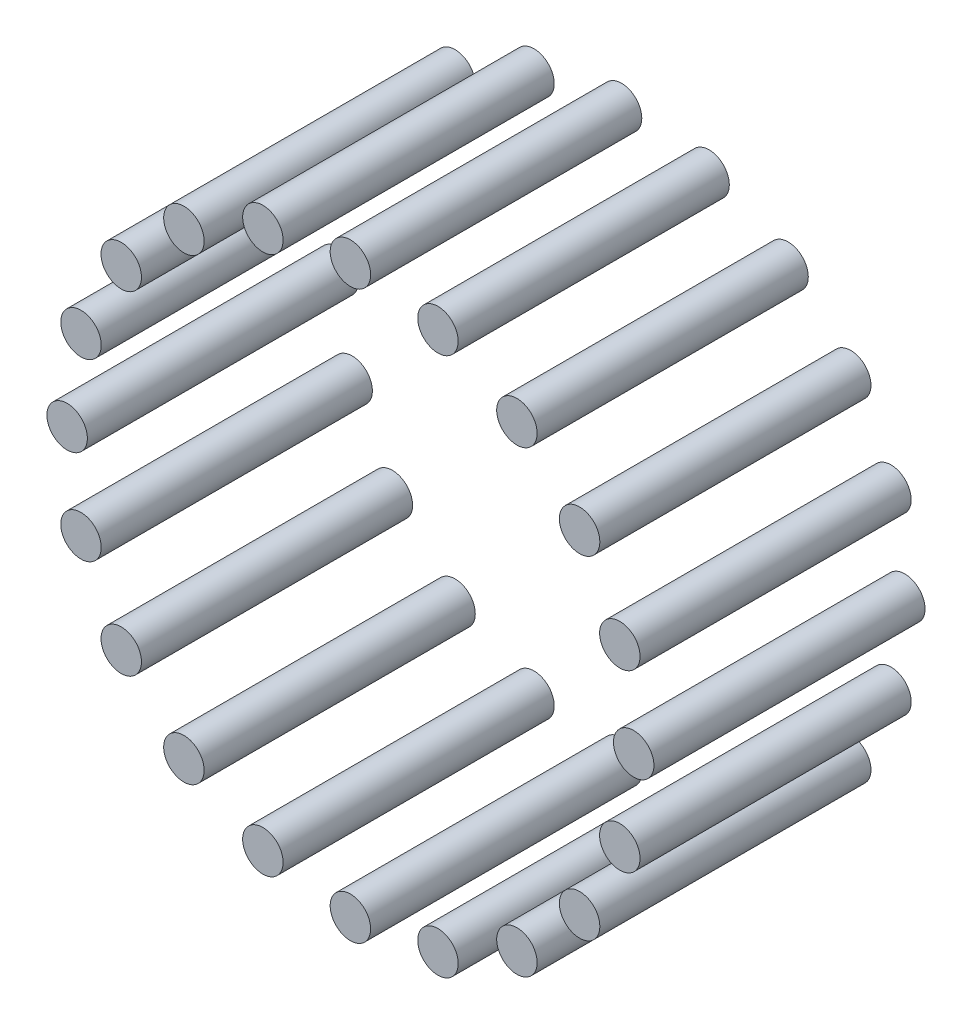
ISO-10303-21;
HEADER;
FILE_DESCRIPTION(('STEP AP214'),'2;1');
FILE_NAME('part.step','',(''),(''),'','','');
FILE_SCHEMA(('AUTOMOTIVE_DESIGN { 1 0 10303 214 1 1 1 1 }'));
ENDSEC;
DATA;
#1=APPLICATION_CONTEXT('core data for automotive mechanical design processes');
#2=APPLICATION_PROTOCOL_DEFINITION('international standard','automotive_design',2000,#1);
#3=PRODUCT_CONTEXT('',#1,'mechanical');
#4=PRODUCT('Part','Part','',(#3));
#5=PRODUCT_RELATED_PRODUCT_CATEGORY('part','',(#4));
#6=PRODUCT_DEFINITION_FORMATION('','',#4);
#7=PRODUCT_DEFINITION_CONTEXT('part definition',#1,'design');
#8=PRODUCT_DEFINITION('design','',#6,#7);
#9=PRODUCT_DEFINITION_SHAPE('','',#8);
#10=(LENGTH_UNIT() NAMED_UNIT(*) SI_UNIT(.MILLI.,.METRE.));
#11=(NAMED_UNIT(*) PLANE_ANGLE_UNIT() SI_UNIT($,.RADIAN.));
#12=(NAMED_UNIT(*) SI_UNIT($,.STERADIAN.) SOLID_ANGLE_UNIT());
#13=UNCERTAINTY_MEASURE_WITH_UNIT(LENGTH_MEASURE(1.E-05),#10,'distance_accuracy_value','');
#14=(GEOMETRIC_REPRESENTATION_CONTEXT(3) GLOBAL_UNCERTAINTY_ASSIGNED_CONTEXT((#13)) GLOBAL_UNIT_ASSIGNED_CONTEXT((#10,
#11,#12)) REPRESENTATION_CONTEXT('',''));
#15=CARTESIAN_POINT('',(0.,0.,0.));
#16=DIRECTION('',(0.,0.,1.));
#17=DIRECTION('',(1.,0.,0.));
#18=AXIS2_PLACEMENT_3D('',#15,#16,#17);
#19=CARTESIAN_POINT('',(-10.8155948031227,33.2869780703305,33.5));
#20=DIRECTION('',(0.,0.,-1.));
#21=DIRECTION('',(-1.,0.,0.));
#22=AXIS2_PLACEMENT_3D('',#19,#20,#21);
#23=CYLINDRICAL_SURFACE('',#22,2.5);
#24=CARTESIAN_POINT('',(-10.8155948031227,33.2869780703305,33.5));
#25=DIRECTION('',(0.,0.,1.));
#26=DIRECTION('',(1.,0.,0.));
#27=AXIS2_PLACEMENT_3D('',#24,#25,#26);
#28=CIRCLE('',#27,2.5);
#29=CARTESIAN_POINT('',(-8.31559480312272,33.2869780703305,33.5));
#30=VERTEX_POINT('',#29);
#31=EDGE_CURVE('E11',#30,#30,#28,.T.);
#32=ORIENTED_EDGE('',*,*,#31,.F.);
#33=EDGE_LOOP('',(#32));
#34=FACE_BOUND('',#33,.T.);
#35=CARTESIAN_POINT('',(-10.8155948031227,33.2869780703305,0.));
#36=DIRECTION('',(0.,0.,1.));
#37=DIRECTION('',(1.,0.,0.));
#38=AXIS2_PLACEMENT_3D('',#35,#36,#37);
#39=CIRCLE('',#38,2.5);
#40=CARTESIAN_POINT('',(-8.31559480312272,33.2869780703305,0.));
#41=VERTEX_POINT('',#40);
#42=EDGE_CURVE('E43',#41,#41,#39,.T.);
#43=ORIENTED_EDGE('',*,*,#42,.T.);
#44=EDGE_LOOP('',(#43));
#45=FACE_BOUND('',#44,.T.);
#46=ADVANCED_FACE('F40',(#34,#45),#23,.T.);
#47=CARTESIAN_POINT('',(-10.8155948031227,33.2869780703305,33.5));
#48=DIRECTION('',(0.,0.,1.));
#49=DIRECTION('',(1.,0.,0.));
#50=AXIS2_PLACEMENT_3D('',#47,#48,#49);
#51=PLANE('',#50);
#52=ORIENTED_EDGE('',*,*,#31,.T.);
#53=EDGE_LOOP('',(#52));
#54=FACE_BOUND('',#53,.T.);
#55=ADVANCED_FACE('F55',(#54),#51,.T.);
#56=CARTESIAN_POINT('',(-10.8155948031227,33.2869780703305,0.));
#57=DIRECTION('',(0.,0.,1.));
#58=DIRECTION('',(1.,0.,0.));
#59=AXIS2_PLACEMENT_3D('',#56,#57,#58);
#60=PLANE('',#59);
#61=ORIENTED_EDGE('',*,*,#42,.F.);
#62=EDGE_LOOP('',(#61));
#63=FACE_BOUND('',#62,.T.);
#64=ADVANCED_FACE('F53',(#63),#60,.F.);
#65=CLOSED_SHELL('',(#46,#55,#64));
#66=MANIFOLD_SOLID_BREP('B2',#65);
#67=CARTESIAN_POINT('',(-20.5724838302363,28.3155948031223,33.5));
#68=DIRECTION('',(0.,0.,-1.));
#69=DIRECTION('',(-1.,0.,0.));
#70=AXIS2_PLACEMENT_3D('',#67,#68,#69);
#71=CYLINDRICAL_SURFACE('',#70,2.50000000000097);
#72=CARTESIAN_POINT('',(-20.5724838302363,28.3155948031223,33.5));
#73=DIRECTION('',(0.,0.,1.));
#74=DIRECTION('',(1.,0.,0.));
#75=AXIS2_PLACEMENT_3D('',#72,#73,#74);
#76=CIRCLE('',#75,2.50000000000097);
#77=CARTESIAN_POINT('',(-18.0724838302353,28.3155948031223,33.5));
#78=VERTEX_POINT('',#77);
#79=EDGE_CURVE('E39',#78,#78,#76,.T.);
#80=ORIENTED_EDGE('',*,*,#79,.F.);
#81=EDGE_LOOP('',(#80));
#82=FACE_BOUND('',#81,.T.);
#83=CARTESIAN_POINT('',(-20.5724838302363,28.3155948031223,0.));
#84=DIRECTION('',(0.,0.,1.));
#85=DIRECTION('',(1.,0.,0.));
#86=AXIS2_PLACEMENT_3D('',#83,#84,#85);
#87=CIRCLE('',#86,2.50000000000097);
#88=CARTESIAN_POINT('',(-18.0724838302353,28.3155948031223,0.));
#89=VERTEX_POINT('',#88);
#90=EDGE_CURVE('E92',#89,#89,#87,.T.);
#91=ORIENTED_EDGE('',*,*,#90,.T.);
#92=EDGE_LOOP('',(#91));
#93=FACE_BOUND('',#92,.T.);
#94=ADVANCED_FACE('F89',(#82,#93),#71,.T.);
#95=CARTESIAN_POINT('',(-20.5724838302363,28.3155948031223,33.5));
#96=DIRECTION('',(0.,0.,1.));
#97=DIRECTION('',(1.,0.,0.));
#98=AXIS2_PLACEMENT_3D('',#95,#96,#97);
#99=PLANE('',#98);
#100=ORIENTED_EDGE('',*,*,#79,.T.);
#101=EDGE_LOOP('',(#100));
#102=FACE_BOUND('',#101,.T.);
#103=ADVANCED_FACE('F104',(#102),#99,.T.);
#104=CARTESIAN_POINT('',(-20.5724838302363,28.3155948031223,0.));
#105=DIRECTION('',(0.,0.,1.));
#106=DIRECTION('',(1.,0.,0.));
#107=AXIS2_PLACEMENT_3D('',#104,#105,#106);
#108=PLANE('',#107);
#109=ORIENTED_EDGE('',*,*,#90,.F.);
#110=EDGE_LOOP('',(#109));
#111=FACE_BOUND('',#110,.T.);
#112=ADVANCED_FACE('F102',(#111),#108,.F.);
#113=CLOSED_SHELL('',(#94,#103,#112));
#114=MANIFOLD_SOLID_BREP('B6',#113);
#115=CARTESIAN_POINT('',(-28.3155948031226,20.5724838302354,33.5));
#116=DIRECTION('',(0.,0.,-1.));
#117=DIRECTION('',(-1.,0.,0.));
#118=AXIS2_PLACEMENT_3D('',#115,#116,#117);
#119=CYLINDRICAL_SURFACE('',#118,2.50000000000135);
#120=CARTESIAN_POINT('',(-28.3155948031226,20.5724838302354,33.5));
#121=DIRECTION('',(0.,0.,1.));
#122=DIRECTION('',(1.,0.,0.));
#123=AXIS2_PLACEMENT_3D('',#120,#121,#122);
#124=CIRCLE('',#123,2.50000000000135);
#125=CARTESIAN_POINT('',(-25.8155948031212,20.5724838302354,33.5));
#126=VERTEX_POINT('',#125);
#127=EDGE_CURVE('E88',#126,#126,#124,.T.);
#128=ORIENTED_EDGE('',*,*,#127,.F.);
#129=EDGE_LOOP('',(#128));
#130=FACE_BOUND('',#129,.T.);
#131=CARTESIAN_POINT('',(-28.3155948031226,20.5724838302354,0.));
#132=DIRECTION('',(0.,0.,1.));
#133=DIRECTION('',(1.,0.,0.));
#134=AXIS2_PLACEMENT_3D('',#131,#132,#133);
#135=CIRCLE('',#134,2.50000000000135);
#136=CARTESIAN_POINT('',(-25.8155948031212,20.5724838302354,0.));
#137=VERTEX_POINT('',#136);
#138=EDGE_CURVE('E141',#137,#137,#135,.T.);
#139=ORIENTED_EDGE('',*,*,#138,.T.);
#140=EDGE_LOOP('',(#139));
#141=FACE_BOUND('',#140,.T.);
#142=ADVANCED_FACE('F138',(#130,#141),#119,.T.);
#143=CARTESIAN_POINT('',(-28.3155948031226,20.5724838302354,33.5));
#144=DIRECTION('',(0.,0.,1.));
#145=DIRECTION('',(1.,0.,0.));
#146=AXIS2_PLACEMENT_3D('',#143,#144,#145);
#147=PLANE('',#146);
#148=ORIENTED_EDGE('',*,*,#127,.T.);
#149=EDGE_LOOP('',(#148));
#150=FACE_BOUND('',#149,.T.);
#151=ADVANCED_FACE('F153',(#150),#147,.T.);
#152=CARTESIAN_POINT('',(-28.3155948031226,20.5724838302354,0.));
#153=DIRECTION('',(0.,0.,1.));
#154=DIRECTION('',(1.,0.,0.));
#155=AXIS2_PLACEMENT_3D('',#152,#153,#154);
#156=PLANE('',#155);
#157=ORIENTED_EDGE('',*,*,#138,.F.);
#158=EDGE_LOOP('',(#157));
#159=FACE_BOUND('',#158,.T.);
#160=ADVANCED_FACE('F151',(#159),#156,.F.);
#161=CLOSED_SHELL('',(#142,#151,#160));
#162=MANIFOLD_SOLID_BREP('B34',#161);
#163=CARTESIAN_POINT('',(-33.2869780703294,10.8155948031217,33.5));
#164=DIRECTION('',(0.,0.,-1.));
#165=DIRECTION('',(-1.,0.,0.));
#166=AXIS2_PLACEMENT_3D('',#163,#164,#165);
#167=CYLINDRICAL_SURFACE('',#166,2.50000000000178);
#168=CARTESIAN_POINT('',(-33.2869780703294,10.8155948031217,33.5));
#169=DIRECTION('',(0.,0.,1.));
#170=DIRECTION('',(1.,0.,0.));
#171=AXIS2_PLACEMENT_3D('',#168,#169,#170);
#172=CIRCLE('',#171,2.50000000000178);
#173=CARTESIAN_POINT('',(-30.7869780703276,10.8155948031217,33.5));
#174=VERTEX_POINT('',#173);
#175=EDGE_CURVE('E137',#174,#174,#172,.T.);
#176=ORIENTED_EDGE('',*,*,#175,.F.);
#177=EDGE_LOOP('',(#176));
#178=FACE_BOUND('',#177,.T.);
#179=CARTESIAN_POINT('',(-33.2869780703294,10.8155948031217,0.));
#180=DIRECTION('',(0.,0.,1.));
#181=DIRECTION('',(1.,0.,0.));
#182=AXIS2_PLACEMENT_3D('',#179,#180,#181);
#183=CIRCLE('',#182,2.50000000000178);
#184=CARTESIAN_POINT('',(-30.7869780703276,10.8155948031217,0.));
#185=VERTEX_POINT('',#184);
#186=EDGE_CURVE('E190',#185,#185,#183,.T.);
#187=ORIENTED_EDGE('',*,*,#186,.T.);
#188=EDGE_LOOP('',(#187));
#189=FACE_BOUND('',#188,.T.);
#190=ADVANCED_FACE('F187',(#178,#189),#167,.T.);
#191=CARTESIAN_POINT('',(-33.2869780703294,10.8155948031217,33.5));
#192=DIRECTION('',(0.,0.,1.));
#193=DIRECTION('',(1.,0.,0.));
#194=AXIS2_PLACEMENT_3D('',#191,#192,#193);
#195=PLANE('',#194);
#196=ORIENTED_EDGE('',*,*,#175,.T.);
#197=EDGE_LOOP('',(#196));
#198=FACE_BOUND('',#197,.T.);
#199=ADVANCED_FACE('F202',(#198),#195,.T.);
#200=CARTESIAN_POINT('',(-33.2869780703294,10.8155948031217,0.));
#201=DIRECTION('',(0.,0.,1.));
#202=DIRECTION('',(1.,0.,0.));
#203=AXIS2_PLACEMENT_3D('',#200,#201,#202);
#204=PLANE('',#203);
#205=ORIENTED_EDGE('',*,*,#186,.F.);
#206=EDGE_LOOP('',(#205));
#207=FACE_BOUND('',#206,.T.);
#208=ADVANCED_FACE('F200',(#207),#204,.F.);
#209=CLOSED_SHELL('',(#190,#199,#208));
#210=MANIFOLD_SOLID_BREP('B83',#209);
#211=CARTESIAN_POINT('',(-34.9999999999985,-1.4899966131977E-12,33.5));
#212=DIRECTION('',(0.,0.,-1.));
#213=DIRECTION('',(-1.,0.,0.));
#214=AXIS2_PLACEMENT_3D('',#211,#212,#213);
#215=CYLINDRICAL_SURFACE('',#214,2.50000000000221);
#216=CARTESIAN_POINT('',(-34.9999999999985,-1.4899966131977E-12,33.5));
#217=DIRECTION('',(0.,0.,1.));
#218=DIRECTION('',(1.,0.,0.));
#219=AXIS2_PLACEMENT_3D('',#216,#217,#218);
#220=CIRCLE('',#219,2.50000000000221);
#221=CARTESIAN_POINT('',(-32.4999999999963,-1.4899966131977E-12,33.5));
#222=VERTEX_POINT('',#221);
#223=EDGE_CURVE('E186',#222,#222,#220,.T.);
#224=ORIENTED_EDGE('',*,*,#223,.F.);
#225=EDGE_LOOP('',(#224));
#226=FACE_BOUND('',#225,.T.);
#227=CARTESIAN_POINT('',(-34.9999999999985,-1.4899966131977E-12,0.));
#228=DIRECTION('',(0.,0.,1.));
#229=DIRECTION('',(1.,0.,0.));
#230=AXIS2_PLACEMENT_3D('',#227,#228,#229);
#231=CIRCLE('',#230,2.50000000000221);
#232=CARTESIAN_POINT('',(-32.4999999999963,-1.4899966131977E-12,0.));
#233=VERTEX_POINT('',#232);
#234=EDGE_CURVE('E239',#233,#233,#231,.T.);
#235=ORIENTED_EDGE('',*,*,#234,.T.);
#236=EDGE_LOOP('',(#235));
#237=FACE_BOUND('',#236,.T.);
#238=ADVANCED_FACE('F236',(#226,#237),#215,.T.);
#239=CARTESIAN_POINT('',(-34.9999999999985,-1.4899966131977E-12,33.5));
#240=DIRECTION('',(0.,0.,1.));
#241=DIRECTION('',(1.,0.,0.));
#242=AXIS2_PLACEMENT_3D('',#239,#240,#241);
#243=PLANE('',#242);
#244=ORIENTED_EDGE('',*,*,#223,.T.);
#245=EDGE_LOOP('',(#244));
#246=FACE_BOUND('',#245,.T.);
#247=ADVANCED_FACE('F251',(#246),#243,.T.);
#248=CARTESIAN_POINT('',(-34.9999999999985,-1.4899966131977E-12,0.));
#249=DIRECTION('',(0.,0.,1.));
#250=DIRECTION('',(1.,0.,0.));
#251=AXIS2_PLACEMENT_3D('',#248,#249,#250);
#252=PLANE('',#251);
#253=ORIENTED_EDGE('',*,*,#234,.F.);
#254=EDGE_LOOP('',(#253));
#255=FACE_BOUND('',#254,.T.);
#256=ADVANCED_FACE('F249',(#255),#252,.F.);
#257=CLOSED_SHELL('',(#238,#247,#256));
#258=MANIFOLD_SOLID_BREP('B132',#257);
#259=CARTESIAN_POINT('',(-33.2869780703284,-10.8155948031246,33.5));
#260=DIRECTION('',(0.,0.,-1.));
#261=DIRECTION('',(-1.,0.,0.));
#262=AXIS2_PLACEMENT_3D('',#259,#260,#261);
#263=CYLINDRICAL_SURFACE('',#262,2.50000000000259);
#264=CARTESIAN_POINT('',(-33.2869780703284,-10.8155948031246,33.5));
#265=DIRECTION('',(0.,0.,1.));
#266=DIRECTION('',(1.,0.,0.));
#267=AXIS2_PLACEMENT_3D('',#264,#265,#266);
#268=CIRCLE('',#267,2.50000000000259);
#269=CARTESIAN_POINT('',(-30.7869780703258,-10.8155948031246,33.5));
#270=VERTEX_POINT('',#269);
#271=EDGE_CURVE('E235',#270,#270,#268,.T.);
#272=ORIENTED_EDGE('',*,*,#271,.F.);
#273=EDGE_LOOP('',(#272));
#274=FACE_BOUND('',#273,.T.);
#275=CARTESIAN_POINT('',(-33.2869780703284,-10.8155948031246,0.));
#276=DIRECTION('',(0.,0.,1.));
#277=DIRECTION('',(1.,0.,0.));
#278=AXIS2_PLACEMENT_3D('',#275,#276,#277);
#279=CIRCLE('',#278,2.50000000000259);
#280=CARTESIAN_POINT('',(-30.7869780703258,-10.8155948031246,0.));
#281=VERTEX_POINT('',#280);
#282=EDGE_CURVE('E288',#281,#281,#279,.T.);
#283=ORIENTED_EDGE('',*,*,#282,.T.);
#284=EDGE_LOOP('',(#283));
#285=FACE_BOUND('',#284,.T.);
#286=ADVANCED_FACE('F285',(#274,#285),#263,.T.);
#287=CARTESIAN_POINT('',(-33.2869780703284,-10.8155948031246,33.5));
#288=DIRECTION('',(0.,0.,1.));
#289=DIRECTION('',(1.,0.,0.));
#290=AXIS2_PLACEMENT_3D('',#287,#288,#289);
#291=PLANE('',#290);
#292=ORIENTED_EDGE('',*,*,#271,.T.);
#293=EDGE_LOOP('',(#292));
#294=FACE_BOUND('',#293,.T.);
#295=ADVANCED_FACE('F300',(#294),#291,.T.);
#296=CARTESIAN_POINT('',(-33.2869780703284,-10.8155948031246,0.));
#297=DIRECTION('',(0.,0.,1.));
#298=DIRECTION('',(1.,0.,0.));
#299=AXIS2_PLACEMENT_3D('',#296,#297,#298);
#300=PLANE('',#299);
#301=ORIENTED_EDGE('',*,*,#282,.F.);
#302=EDGE_LOOP('',(#301));
#303=FACE_BOUND('',#302,.T.);
#304=ADVANCED_FACE('F298',(#303),#300,.F.);
#305=CLOSED_SHELL('',(#286,#295,#304));
#306=MANIFOLD_SOLID_BREP('B181',#305);
#307=CARTESIAN_POINT('',(-28.3155948031208,-20.5724838302378,33.5));
#308=DIRECTION('',(0.,0.,-1.));
#309=DIRECTION('',(-1.,0.,0.));
#310=AXIS2_PLACEMENT_3D('',#307,#308,#309);
#311=CYLINDRICAL_SURFACE('',#310,2.50000000000294);
#312=CARTESIAN_POINT('',(-28.3155948031208,-20.5724838302378,33.5));
#313=DIRECTION('',(0.,0.,1.));
#314=DIRECTION('',(1.,0.,0.));
#315=AXIS2_PLACEMENT_3D('',#312,#313,#314);
#316=CIRCLE('',#315,2.50000000000294);
#317=CARTESIAN_POINT('',(-25.8155948031179,-20.5724838302378,33.5));
#318=VERTEX_POINT('',#317);
#319=EDGE_CURVE('E284',#318,#318,#316,.T.);
#320=ORIENTED_EDGE('',*,*,#319,.F.);
#321=EDGE_LOOP('',(#320));
#322=FACE_BOUND('',#321,.T.);
#323=CARTESIAN_POINT('',(-28.3155948031208,-20.5724838302378,0.));
#324=DIRECTION('',(0.,0.,1.));
#325=DIRECTION('',(1.,0.,0.));
#326=AXIS2_PLACEMENT_3D('',#323,#324,#325);
#327=CIRCLE('',#326,2.50000000000294);
#328=CARTESIAN_POINT('',(-25.8155948031179,-20.5724838302378,0.));
#329=VERTEX_POINT('',#328);
#330=EDGE_CURVE('E337',#329,#329,#327,.T.);
#331=ORIENTED_EDGE('',*,*,#330,.T.);
#332=EDGE_LOOP('',(#331));
#333=FACE_BOUND('',#332,.T.);
#334=ADVANCED_FACE('F334',(#322,#333),#311,.T.);
#335=CARTESIAN_POINT('',(-28.3155948031208,-20.5724838302378,33.5));
#336=DIRECTION('',(0.,0.,1.));
#337=DIRECTION('',(1.,0.,0.));
#338=AXIS2_PLACEMENT_3D('',#335,#336,#337);
#339=PLANE('',#338);
#340=ORIENTED_EDGE('',*,*,#319,.T.);
#341=EDGE_LOOP('',(#340));
#342=FACE_BOUND('',#341,.T.);
#343=ADVANCED_FACE('F349',(#342),#339,.T.);
#344=CARTESIAN_POINT('',(-28.3155948031208,-20.5724838302378,0.));
#345=DIRECTION('',(0.,0.,1.));
#346=DIRECTION('',(1.,0.,0.));
#347=AXIS2_PLACEMENT_3D('',#344,#345,#346);
#348=PLANE('',#347);
#349=ORIENTED_EDGE('',*,*,#330,.F.);
#350=EDGE_LOOP('',(#349));
#351=FACE_BOUND('',#350,.T.);
#352=ADVANCED_FACE('F347',(#351),#348,.F.);
#353=CLOSED_SHELL('',(#334,#343,#352));
#354=MANIFOLD_SOLID_BREP('B230',#353);
#355=CARTESIAN_POINT('',(-20.5724838302339,-28.315594803124,33.5));
#356=DIRECTION('',(0.,0.,-1.));
#357=DIRECTION('',(-1.,0.,0.));
#358=AXIS2_PLACEMENT_3D('',#355,#356,#357);
#359=CYLINDRICAL_SURFACE('',#358,2.50000000000312);
#360=CARTESIAN_POINT('',(-20.5724838302339,-28.315594803124,33.5));
#361=DIRECTION('',(0.,0.,1.));
#362=DIRECTION('',(1.,0.,0.));
#363=AXIS2_PLACEMENT_3D('',#360,#361,#362);
#364=CIRCLE('',#363,2.50000000000312);
#365=CARTESIAN_POINT('',(-18.0724838302308,-28.315594803124,33.5));
#366=VERTEX_POINT('',#365);
#367=EDGE_CURVE('E333',#366,#366,#364,.T.);
#368=ORIENTED_EDGE('',*,*,#367,.F.);
#369=EDGE_LOOP('',(#368));
#370=FACE_BOUND('',#369,.T.);
#371=CARTESIAN_POINT('',(-20.5724838302339,-28.315594803124,0.));
#372=DIRECTION('',(0.,0.,1.));
#373=DIRECTION('',(1.,0.,0.));
#374=AXIS2_PLACEMENT_3D('',#371,#372,#373);
#375=CIRCLE('',#374,2.50000000000312);
#376=CARTESIAN_POINT('',(-18.0724838302308,-28.315594803124,0.));
#377=VERTEX_POINT('',#376);
#378=EDGE_CURVE('E386',#377,#377,#375,.T.);
#379=ORIENTED_EDGE('',*,*,#378,.T.);
#380=EDGE_LOOP('',(#379));
#381=FACE_BOUND('',#380,.T.);
#382=ADVANCED_FACE('F383',(#370,#381),#359,.T.);
#383=CARTESIAN_POINT('',(-20.5724838302339,-28.315594803124,33.5));
#384=DIRECTION('',(0.,0.,1.));
#385=DIRECTION('',(1.,0.,0.));
#386=AXIS2_PLACEMENT_3D('',#383,#384,#385);
#387=PLANE('',#386);
#388=ORIENTED_EDGE('',*,*,#367,.T.);
#389=EDGE_LOOP('',(#388));
#390=FACE_BOUND('',#389,.T.);
#391=ADVANCED_FACE('F398',(#390),#387,.T.);
#392=CARTESIAN_POINT('',(-20.5724838302339,-28.315594803124,0.));
#393=DIRECTION('',(0.,0.,1.));
#394=DIRECTION('',(1.,0.,0.));
#395=AXIS2_PLACEMENT_3D('',#392,#393,#394);
#396=PLANE('',#395);
#397=ORIENTED_EDGE('',*,*,#378,.F.);
#398=EDGE_LOOP('',(#397));
#399=FACE_BOUND('',#398,.T.);
#400=ADVANCED_FACE('F396',(#399),#396,.F.);
#401=CLOSED_SHELL('',(#382,#391,#400));
#402=MANIFOLD_SOLID_BREP('B279',#401);
#403=CARTESIAN_POINT('',(-10.8155948031203,-33.2869780703308,33.5));
#404=DIRECTION('',(0.,0.,-1.));
#405=DIRECTION('',(-1.,0.,0.));
#406=AXIS2_PLACEMENT_3D('',#403,#404,#405);
#407=CYLINDRICAL_SURFACE('',#406,2.50000000000317);
#408=CARTESIAN_POINT('',(-10.8155948031203,-33.2869780703308,33.5));
#409=DIRECTION('',(0.,0.,1.));
#410=DIRECTION('',(1.,0.,0.));
#411=AXIS2_PLACEMENT_3D('',#408,#409,#410);
#412=CIRCLE('',#411,2.50000000000317);
#413=CARTESIAN_POINT('',(-8.31559480311709,-33.2869780703308,33.5));
#414=VERTEX_POINT('',#413);
#415=EDGE_CURVE('E382',#414,#414,#412,.T.);
#416=ORIENTED_EDGE('',*,*,#415,.F.);
#417=EDGE_LOOP('',(#416));
#418=FACE_BOUND('',#417,.T.);
#419=CARTESIAN_POINT('',(-10.8155948031203,-33.2869780703308,0.));
#420=DIRECTION('',(0.,0.,1.));
#421=DIRECTION('',(1.,0.,0.));
#422=AXIS2_PLACEMENT_3D('',#419,#420,#421);
#423=CIRCLE('',#422,2.50000000000317);
#424=CARTESIAN_POINT('',(-8.31559480311709,-33.2869780703308,0.));
#425=VERTEX_POINT('',#424);
#426=EDGE_CURVE('E435',#425,#425,#423,.T.);
#427=ORIENTED_EDGE('',*,*,#426,.T.);
#428=EDGE_LOOP('',(#427));
#429=FACE_BOUND('',#428,.T.);
#430=ADVANCED_FACE('F432',(#418,#429),#407,.T.);
#431=CARTESIAN_POINT('',(-10.8155948031203,-33.2869780703308,33.5));
#432=DIRECTION('',(0.,0.,1.));
#433=DIRECTION('',(1.,0.,0.));
#434=AXIS2_PLACEMENT_3D('',#431,#432,#433);
#435=PLANE('',#434);
#436=ORIENTED_EDGE('',*,*,#415,.T.);
#437=EDGE_LOOP('',(#436));
#438=FACE_BOUND('',#437,.T.);
#439=ADVANCED_FACE('F447',(#438),#435,.T.);
#440=CARTESIAN_POINT('',(-10.8155948031203,-33.2869780703308,0.));
#441=DIRECTION('',(0.,0.,1.));
#442=DIRECTION('',(1.,0.,0.));
#443=AXIS2_PLACEMENT_3D('',#440,#441,#442);
#444=PLANE('',#443);
#445=ORIENTED_EDGE('',*,*,#426,.F.);
#446=EDGE_LOOP('',(#445));
#447=FACE_BOUND('',#446,.T.);
#448=ADVANCED_FACE('F445',(#447),#444,.F.);
#449=CLOSED_SHELL('',(#430,#439,#448));
#450=MANIFOLD_SOLID_BREP('B328',#449);
#451=CARTESIAN_POINT('',(2.97142069880137E-12,-35.,33.5));
#452=DIRECTION('',(0.,0.,-1.));
#453=DIRECTION('',(-1.,0.,0.));
#454=AXIS2_PLACEMENT_3D('',#451,#452,#453);
#455=CYLINDRICAL_SURFACE('',#454,2.50000000000308);
#456=CARTESIAN_POINT('',(2.97142069880137E-12,-35.,33.5));
#457=DIRECTION('',(0.,0.,1.));
#458=DIRECTION('',(1.,0.,0.));
#459=AXIS2_PLACEMENT_3D('',#456,#457,#458);
#460=CIRCLE('',#459,2.50000000000308);
#461=CARTESIAN_POINT('',(2.50000000000605,-35.,33.5));
#462=VERTEX_POINT('',#461);
#463=EDGE_CURVE('E431',#462,#462,#460,.T.);
#464=ORIENTED_EDGE('',*,*,#463,.F.);
#465=EDGE_LOOP('',(#464));
#466=FACE_BOUND('',#465,.T.);
#467=CARTESIAN_POINT('',(2.97142069880137E-12,-35.,0.));
#468=DIRECTION('',(0.,0.,1.));
#469=DIRECTION('',(1.,0.,0.));
#470=AXIS2_PLACEMENT_3D('',#467,#468,#469);
#471=CIRCLE('',#470,2.50000000000308);
#472=CARTESIAN_POINT('',(2.50000000000605,-35.,0.));
#473=VERTEX_POINT('',#472);
#474=EDGE_CURVE('E484',#473,#473,#471,.T.);
#475=ORIENTED_EDGE('',*,*,#474,.T.);
#476=EDGE_LOOP('',(#475));
#477=FACE_BOUND('',#476,.T.);
#478=ADVANCED_FACE('F481',(#466,#477),#455,.T.);
#479=CARTESIAN_POINT('',(2.97142069880137E-12,-35.,33.5));
#480=DIRECTION('',(0.,0.,1.));
#481=DIRECTION('',(1.,0.,0.));
#482=AXIS2_PLACEMENT_3D('',#479,#480,#481);
#483=PLANE('',#482);
#484=ORIENTED_EDGE('',*,*,#463,.T.);
#485=EDGE_LOOP('',(#484));
#486=FACE_BOUND('',#485,.T.);
#487=ADVANCED_FACE('F496',(#486),#483,.T.);
#488=CARTESIAN_POINT('',(2.97142069880137E-12,-35.,0.));
#489=DIRECTION('',(0.,0.,1.));
#490=DIRECTION('',(1.,0.,0.));
#491=AXIS2_PLACEMENT_3D('',#488,#489,#490);
#492=PLANE('',#491);
#493=ORIENTED_EDGE('',*,*,#474,.F.);
#494=EDGE_LOOP('',(#493));
#495=FACE_BOUND('',#494,.T.);
#496=ADVANCED_FACE('F494',(#495),#492,.F.);
#497=CLOSED_SHELL('',(#478,#487,#496));
#498=MANIFOLD_SOLID_BREP('B377',#497);
#499=CARTESIAN_POINT('',(10.8155948031261,-33.2869780703299,33.5));
#500=DIRECTION('',(0.,0.,-1.));
#501=DIRECTION('',(-1.,0.,0.));
#502=AXIS2_PLACEMENT_3D('',#499,#500,#501);
#503=CYLINDRICAL_SURFACE('',#502,2.50000000000286);
#504=CARTESIAN_POINT('',(10.8155948031261,-33.2869780703299,33.5));
#505=DIRECTION('',(0.,0.,1.));
#506=DIRECTION('',(1.,0.,0.));
#507=AXIS2_PLACEMENT_3D('',#504,#505,#506);
#508=CIRCLE('',#507,2.50000000000286);
#509=CARTESIAN_POINT('',(13.3155948031289,-33.2869780703299,33.5));
#510=VERTEX_POINT('',#509);
#511=EDGE_CURVE('E480',#510,#510,#508,.T.);
#512=ORIENTED_EDGE('',*,*,#511,.F.);
#513=EDGE_LOOP('',(#512));
#514=FACE_BOUND('',#513,.T.);
#515=CARTESIAN_POINT('',(10.8155948031261,-33.2869780703299,0.));
#516=DIRECTION('',(0.,0.,1.));
#517=DIRECTION('',(1.,0.,0.));
#518=AXIS2_PLACEMENT_3D('',#515,#516,#517);
#519=CIRCLE('',#518,2.50000000000286);
#520=CARTESIAN_POINT('',(13.3155948031289,-33.2869780703299,0.));
#521=VERTEX_POINT('',#520);
#522=EDGE_CURVE('E533',#521,#521,#519,.T.);
#523=ORIENTED_EDGE('',*,*,#522,.T.);
#524=EDGE_LOOP('',(#523));
#525=FACE_BOUND('',#524,.T.);
#526=ADVANCED_FACE('F530',(#514,#525),#503,.T.);
#527=CARTESIAN_POINT('',(10.8155948031261,-33.2869780703299,33.5));
#528=DIRECTION('',(0.,0.,1.));
#529=DIRECTION('',(1.,0.,0.));
#530=AXIS2_PLACEMENT_3D('',#527,#528,#529);
#531=PLANE('',#530);
#532=ORIENTED_EDGE('',*,*,#511,.T.);
#533=EDGE_LOOP('',(#532));
#534=FACE_BOUND('',#533,.T.);
#535=ADVANCED_FACE('F545',(#534),#531,.T.);
#536=CARTESIAN_POINT('',(10.8155948031261,-33.2869780703299,0.));
#537=DIRECTION('',(0.,0.,1.));
#538=DIRECTION('',(1.,0.,0.));
#539=AXIS2_PLACEMENT_3D('',#536,#537,#538);
#540=PLANE('',#539);
#541=ORIENTED_EDGE('',*,*,#522,.F.);
#542=EDGE_LOOP('',(#541));
#543=FACE_BOUND('',#542,.T.);
#544=ADVANCED_FACE('F543',(#543),#540,.F.);
#545=CLOSED_SHELL('',(#526,#535,#544));
#546=MANIFOLD_SOLID_BREP('B426',#545);
#547=CARTESIAN_POINT('',(20.5724838302392,-28.3155948031223,33.5));
#548=DIRECTION('',(0.,0.,-1.));
#549=DIRECTION('',(-1.,0.,0.));
#550=AXIS2_PLACEMENT_3D('',#547,#548,#549);
#551=CYLINDRICAL_SURFACE('',#550,2.50000000000251);
#552=CARTESIAN_POINT('',(20.5724838302392,-28.3155948031223,33.5));
#553=DIRECTION('',(0.,0.,1.));
#554=DIRECTION('',(1.,0.,0.));
#555=AXIS2_PLACEMENT_3D('',#552,#553,#554);
#556=CIRCLE('',#555,2.50000000000251);
#557=CARTESIAN_POINT('',(23.0724838302418,-28.3155948031223,33.5));
#558=VERTEX_POINT('',#557);
#559=EDGE_CURVE('E529',#558,#558,#556,.T.);
#560=ORIENTED_EDGE('',*,*,#559,.F.);
#561=EDGE_LOOP('',(#560));
#562=FACE_BOUND('',#561,.T.);
#563=CARTESIAN_POINT('',(20.5724838302392,-28.3155948031223,0.));
#564=DIRECTION('',(0.,0.,1.));
#565=DIRECTION('',(1.,0.,0.));
#566=AXIS2_PLACEMENT_3D('',#563,#564,#565);
#567=CIRCLE('',#566,2.50000000000251);
#568=CARTESIAN_POINT('',(23.0724838302418,-28.3155948031223,0.));
#569=VERTEX_POINT('',#568);
#570=EDGE_CURVE('E582',#569,#569,#567,.T.);
#571=ORIENTED_EDGE('',*,*,#570,.T.);
#572=EDGE_LOOP('',(#571));
#573=FACE_BOUND('',#572,.T.);
#574=ADVANCED_FACE('F579',(#562,#573),#551,.T.);
#575=CARTESIAN_POINT('',(20.5724838302392,-28.3155948031223,33.5));
#576=DIRECTION('',(0.,0.,1.));
#577=DIRECTION('',(1.,0.,0.));
#578=AXIS2_PLACEMENT_3D('',#575,#576,#577);
#579=PLANE('',#578);
#580=ORIENTED_EDGE('',*,*,#559,.T.);
#581=EDGE_LOOP('',(#580));
#582=FACE_BOUND('',#581,.T.);
#583=ADVANCED_FACE('F594',(#582),#579,.T.);
#584=CARTESIAN_POINT('',(20.5724838302392,-28.3155948031223,0.));
#585=DIRECTION('',(0.,0.,1.));
#586=DIRECTION('',(1.,0.,0.));
#587=AXIS2_PLACEMENT_3D('',#584,#585,#586);
#588=PLANE('',#587);
#589=ORIENTED_EDGE('',*,*,#570,.F.);
#590=EDGE_LOOP('',(#589));
#591=FACE_BOUND('',#590,.T.);
#592=ADVANCED_FACE('F592',(#591),#588,.F.);
#593=CLOSED_SHELL('',(#574,#583,#592));
#594=MANIFOLD_SOLID_BREP('B475',#593);
#595=CARTESIAN_POINT('',(28.3155948031255,-20.5724838302354,33.5));
#596=DIRECTION('',(0.,0.,-1.));
#597=DIRECTION('',(-1.,0.,0.));
#598=AXIS2_PLACEMENT_3D('',#595,#596,#597);
#599=CYLINDRICAL_SURFACE('',#598,2.50000000000206);
#600=CARTESIAN_POINT('',(28.3155948031255,-20.5724838302354,33.5));
#601=DIRECTION('',(0.,0.,1.));
#602=DIRECTION('',(1.,0.,0.));
#603=AXIS2_PLACEMENT_3D('',#600,#601,#602);
#604=CIRCLE('',#603,2.50000000000206);
#605=CARTESIAN_POINT('',(30.8155948031276,-20.5724838302354,33.5));
#606=VERTEX_POINT('',#605);
#607=EDGE_CURVE('E578',#606,#606,#604,.T.);
#608=ORIENTED_EDGE('',*,*,#607,.F.);
#609=EDGE_LOOP('',(#608));
#610=FACE_BOUND('',#609,.T.);
#611=CARTESIAN_POINT('',(28.3155948031255,-20.5724838302354,0.));
#612=DIRECTION('',(0.,0.,1.));
#613=DIRECTION('',(1.,0.,0.));
#614=AXIS2_PLACEMENT_3D('',#611,#612,#613);
#615=CIRCLE('',#614,2.50000000000206);
#616=CARTESIAN_POINT('',(30.8155948031276,-20.5724838302354,0.));
#617=VERTEX_POINT('',#616);
#618=EDGE_CURVE('E631',#617,#617,#615,.T.);
#619=ORIENTED_EDGE('',*,*,#618,.T.);
#620=EDGE_LOOP('',(#619));
#621=FACE_BOUND('',#620,.T.);
#622=ADVANCED_FACE('F628',(#610,#621),#599,.T.);
#623=CARTESIAN_POINT('',(28.3155948031255,-20.5724838302354,33.5));
#624=DIRECTION('',(0.,0.,1.));
#625=DIRECTION('',(1.,0.,0.));
#626=AXIS2_PLACEMENT_3D('',#623,#624,#625);
#627=PLANE('',#626);
#628=ORIENTED_EDGE('',*,*,#607,.T.);
#629=EDGE_LOOP('',(#628));
#630=FACE_BOUND('',#629,.T.);
#631=ADVANCED_FACE('F643',(#630),#627,.T.);
#632=CARTESIAN_POINT('',(28.3155948031255,-20.5724838302354,0.));
#633=DIRECTION('',(0.,0.,1.));
#634=DIRECTION('',(1.,0.,0.));
#635=AXIS2_PLACEMENT_3D('',#632,#633,#634);
#636=PLANE('',#635);
#637=ORIENTED_EDGE('',*,*,#618,.F.);
#638=EDGE_LOOP('',(#637));
#639=FACE_BOUND('',#638,.T.);
#640=ADVANCED_FACE('F641',(#639),#636,.F.);
#641=CLOSED_SHELL('',(#622,#631,#640));
#642=MANIFOLD_SOLID_BREP('B524',#641);
#643=CARTESIAN_POINT('',(33.2869780703323,-10.8155948031217,33.5));
#644=DIRECTION('',(0.,0.,-1.));
#645=DIRECTION('',(-1.,0.,0.));
#646=AXIS2_PLACEMENT_3D('',#643,#644,#645);
#647=CYLINDRICAL_SURFACE('',#646,2.5000000000016);
#648=CARTESIAN_POINT('',(33.2869780703323,-10.8155948031217,33.5));
#649=DIRECTION('',(0.,0.,1.));
#650=DIRECTION('',(1.,0.,0.));
#651=AXIS2_PLACEMENT_3D('',#648,#649,#650);
#652=CIRCLE('',#651,2.5000000000016);
#653=CARTESIAN_POINT('',(35.7869780703339,-10.8155948031217,33.5));
#654=VERTEX_POINT('',#653);
#655=EDGE_CURVE('E627',#654,#654,#652,.T.);
#656=ORIENTED_EDGE('',*,*,#655,.F.);
#657=EDGE_LOOP('',(#656));
#658=FACE_BOUND('',#657,.T.);
#659=CARTESIAN_POINT('',(33.2869780703323,-10.8155948031217,0.));
#660=DIRECTION('',(0.,0.,1.));
#661=DIRECTION('',(1.,0.,0.));
#662=AXIS2_PLACEMENT_3D('',#659,#660,#661);
#663=CIRCLE('',#662,2.5000000000016);
#664=CARTESIAN_POINT('',(35.7869780703339,-10.8155948031217,0.));
#665=VERTEX_POINT('',#664);
#666=EDGE_CURVE('E680',#665,#665,#663,.T.);
#667=ORIENTED_EDGE('',*,*,#666,.T.);
#668=EDGE_LOOP('',(#667));
#669=FACE_BOUND('',#668,.T.);
#670=ADVANCED_FACE('F677',(#658,#669),#647,.T.);
#671=CARTESIAN_POINT('',(33.2869780703323,-10.8155948031217,33.5));
#672=DIRECTION('',(0.,0.,1.));
#673=DIRECTION('',(1.,0.,0.));
#674=AXIS2_PLACEMENT_3D('',#671,#672,#673);
#675=PLANE('',#674);
#676=ORIENTED_EDGE('',*,*,#655,.T.);
#677=EDGE_LOOP('',(#676));
#678=FACE_BOUND('',#677,.T.);
#679=ADVANCED_FACE('F692',(#678),#675,.T.);
#680=CARTESIAN_POINT('',(33.2869780703323,-10.8155948031217,0.));
#681=DIRECTION('',(0.,0.,1.));
#682=DIRECTION('',(1.,0.,0.));
#683=AXIS2_PLACEMENT_3D('',#680,#681,#682);
#684=PLANE('',#683);
#685=ORIENTED_EDGE('',*,*,#666,.F.);
#686=EDGE_LOOP('',(#685));
#687=FACE_BOUND('',#686,.T.);
#688=ADVANCED_FACE('F690',(#687),#684,.F.);
#689=CLOSED_SHELL('',(#670,#679,#688));
#690=MANIFOLD_SOLID_BREP('B573',#689);
#691=CARTESIAN_POINT('',(35.0000000000015,1.48571034940069E-12,33.5));
#692=DIRECTION('',(0.,0.,-1.));
#693=DIRECTION('',(-1.,0.,0.));
#694=AXIS2_PLACEMENT_3D('',#691,#692,#693);
#695=CYLINDRICAL_SURFACE('',#694,2.5000000000011);
#696=CARTESIAN_POINT('',(35.0000000000015,1.48571034940069E-12,33.5));
#697=DIRECTION('',(0.,0.,1.));
#698=DIRECTION('',(1.,0.,0.));
#699=AXIS2_PLACEMENT_3D('',#696,#697,#698);
#700=CIRCLE('',#699,2.5000000000011);
#701=CARTESIAN_POINT('',(37.5000000000026,1.48571034940069E-12,33.5));
#702=VERTEX_POINT('',#701);
#703=EDGE_CURVE('E676',#702,#702,#700,.T.);
#704=ORIENTED_EDGE('',*,*,#703,.F.);
#705=EDGE_LOOP('',(#704));
#706=FACE_BOUND('',#705,.T.);
#707=CARTESIAN_POINT('',(35.0000000000015,1.48571034940069E-12,0.));
#708=DIRECTION('',(0.,0.,1.));
#709=DIRECTION('',(1.,0.,0.));
#710=AXIS2_PLACEMENT_3D('',#707,#708,#709);
#711=CIRCLE('',#710,2.5000000000011);
#712=CARTESIAN_POINT('',(37.5000000000026,1.48571034940069E-12,0.));
#713=VERTEX_POINT('',#712);
#714=EDGE_CURVE('E729',#713,#713,#711,.T.);
#715=ORIENTED_EDGE('',*,*,#714,.T.);
#716=EDGE_LOOP('',(#715));
#717=FACE_BOUND('',#716,.T.);
#718=ADVANCED_FACE('F726',(#706,#717),#695,.T.);
#719=CARTESIAN_POINT('',(35.0000000000015,1.48571034940069E-12,33.5));
#720=DIRECTION('',(0.,0.,1.));
#721=DIRECTION('',(1.,0.,0.));
#722=AXIS2_PLACEMENT_3D('',#719,#720,#721);
#723=PLANE('',#722);
#724=ORIENTED_EDGE('',*,*,#703,.T.);
#725=EDGE_LOOP('',(#724));
#726=FACE_BOUND('',#725,.T.);
#727=ADVANCED_FACE('F741',(#726),#723,.T.);
#728=CARTESIAN_POINT('',(35.0000000000015,1.48571034940069E-12,0.));
#729=DIRECTION('',(0.,0.,1.));
#730=DIRECTION('',(1.,0.,0.));
#731=AXIS2_PLACEMENT_3D('',#728,#729,#730);
#732=PLANE('',#731);
#733=ORIENTED_EDGE('',*,*,#714,.F.);
#734=EDGE_LOOP('',(#733));
#735=FACE_BOUND('',#734,.T.);
#736=ADVANCED_FACE('F739',(#735),#732,.F.);
#737=CLOSED_SHELL('',(#718,#727,#736));
#738=MANIFOLD_SOLID_BREP('B622',#737);
#739=CARTESIAN_POINT('',(33.2869780703314,10.8155948031246,33.5));
#740=DIRECTION('',(0.,0.,-1.));
#741=DIRECTION('',(-1.,0.,0.));
#742=AXIS2_PLACEMENT_3D('',#739,#740,#741);
#743=CYLINDRICAL_SURFACE('',#742,2.50000000000066);
#744=CARTESIAN_POINT('',(33.2869780703314,10.8155948031246,33.5));
#745=DIRECTION('',(0.,0.,1.));
#746=DIRECTION('',(1.,0.,0.));
#747=AXIS2_PLACEMENT_3D('',#744,#745,#746);
#748=CIRCLE('',#747,2.50000000000066);
#749=CARTESIAN_POINT('',(35.7869780703321,10.8155948031246,33.5));
#750=VERTEX_POINT('',#749);
#751=EDGE_CURVE('E725',#750,#750,#748,.T.);
#752=ORIENTED_EDGE('',*,*,#751,.F.);
#753=EDGE_LOOP('',(#752));
#754=FACE_BOUND('',#753,.T.);
#755=CARTESIAN_POINT('',(33.2869780703314,10.8155948031246,0.));
#756=DIRECTION('',(0.,0.,1.));
#757=DIRECTION('',(1.,0.,0.));
#758=AXIS2_PLACEMENT_3D('',#755,#756,#757);
#759=CIRCLE('',#758,2.50000000000066);
#760=CARTESIAN_POINT('',(35.7869780703321,10.8155948031246,0.));
#761=VERTEX_POINT('',#760);
#762=EDGE_CURVE('E778',#761,#761,#759,.T.);
#763=ORIENTED_EDGE('',*,*,#762,.T.);
#764=EDGE_LOOP('',(#763));
#765=FACE_BOUND('',#764,.T.);
#766=ADVANCED_FACE('F775',(#754,#765),#743,.T.);
#767=CARTESIAN_POINT('',(33.2869780703314,10.8155948031246,33.5));
#768=DIRECTION('',(0.,0.,1.));
#769=DIRECTION('',(1.,0.,0.));
#770=AXIS2_PLACEMENT_3D('',#767,#768,#769);
#771=PLANE('',#770);
#772=ORIENTED_EDGE('',*,*,#751,.T.);
#773=EDGE_LOOP('',(#772));
#774=FACE_BOUND('',#773,.T.);
#775=ADVANCED_FACE('F790',(#774),#771,.T.);
#776=CARTESIAN_POINT('',(33.2869780703314,10.8155948031246,0.));
#777=DIRECTION('',(0.,0.,1.));
#778=DIRECTION('',(1.,0.,0.));
#779=AXIS2_PLACEMENT_3D('',#776,#777,#778);
#780=PLANE('',#779);
#781=ORIENTED_EDGE('',*,*,#762,.F.);
#782=EDGE_LOOP('',(#781));
#783=FACE_BOUND('',#782,.T.);
#784=ADVANCED_FACE('F788',(#783),#780,.F.);
#785=CLOSED_SHELL('',(#766,#775,#784));
#786=MANIFOLD_SOLID_BREP('B671',#785);
#787=CARTESIAN_POINT('',(28.3155948031238,20.5724838302378,33.5));
#788=DIRECTION('',(0.,0.,-1.));
#789=DIRECTION('',(-1.,0.,0.));
#790=AXIS2_PLACEMENT_3D('',#787,#788,#789);
#791=CYLINDRICAL_SURFACE('',#790,2.5000000000003);
#792=CARTESIAN_POINT('',(28.3155948031238,20.5724838302378,33.5));
#793=DIRECTION('',(0.,0.,1.));
#794=DIRECTION('',(1.,0.,0.));
#795=AXIS2_PLACEMENT_3D('',#792,#793,#794);
#796=CIRCLE('',#795,2.5000000000003);
#797=CARTESIAN_POINT('',(30.8155948031241,20.5724838302378,33.5));
#798=VERTEX_POINT('',#797);
#799=EDGE_CURVE('E774',#798,#798,#796,.T.);
#800=ORIENTED_EDGE('',*,*,#799,.F.);
#801=EDGE_LOOP('',(#800));
#802=FACE_BOUND('',#801,.T.);
#803=CARTESIAN_POINT('',(28.3155948031238,20.5724838302378,0.));
#804=DIRECTION('',(0.,0.,1.));
#805=DIRECTION('',(1.,0.,0.));
#806=AXIS2_PLACEMENT_3D('',#803,#804,#805);
#807=CIRCLE('',#806,2.5000000000003);
#808=CARTESIAN_POINT('',(30.8155948031241,20.5724838302378,0.));
#809=VERTEX_POINT('',#808);
#810=EDGE_CURVE('E827',#809,#809,#807,.T.);
#811=ORIENTED_EDGE('',*,*,#810,.T.);
#812=EDGE_LOOP('',(#811));
#813=FACE_BOUND('',#812,.T.);
#814=ADVANCED_FACE('F824',(#802,#813),#791,.T.);
#815=CARTESIAN_POINT('',(28.3155948031238,20.5724838302378,33.5));
#816=DIRECTION('',(0.,0.,1.));
#817=DIRECTION('',(1.,0.,0.));
#818=AXIS2_PLACEMENT_3D('',#815,#816,#817);
#819=PLANE('',#818);
#820=ORIENTED_EDGE('',*,*,#799,.T.);
#821=EDGE_LOOP('',(#820));
#822=FACE_BOUND('',#821,.T.);
#823=ADVANCED_FACE('F839',(#822),#819,.T.);
#824=CARTESIAN_POINT('',(28.3155948031238,20.5724838302378,0.));
#825=DIRECTION('',(0.,0.,1.));
#826=DIRECTION('',(1.,0.,0.));
#827=AXIS2_PLACEMENT_3D('',#824,#825,#826);
#828=PLANE('',#827);
#829=ORIENTED_EDGE('',*,*,#810,.F.);
#830=EDGE_LOOP('',(#829));
#831=FACE_BOUND('',#830,.T.);
#832=ADVANCED_FACE('F837',(#831),#828,.F.);
#833=CLOSED_SHELL('',(#814,#823,#832));
#834=MANIFOLD_SOLID_BREP('B720',#833);
#835=CARTESIAN_POINT('',(20.5724838302368,28.315594803124,33.5));
#836=DIRECTION('',(0.,0.,-1.));
#837=DIRECTION('',(-1.,0.,0.));
#838=AXIS2_PLACEMENT_3D('',#835,#836,#837);
#839=CYLINDRICAL_SURFACE('',#838,2.50000000000006);
#840=CARTESIAN_POINT('',(20.5724838302368,28.315594803124,33.5));
#841=DIRECTION('',(0.,0.,1.));
#842=DIRECTION('',(1.,0.,0.));
#843=AXIS2_PLACEMENT_3D('',#840,#841,#842);
#844=CIRCLE('',#843,2.50000000000006);
#845=CARTESIAN_POINT('',(23.0724838302369,28.315594803124,33.5));
#846=VERTEX_POINT('',#845);
#847=EDGE_CURVE('E823',#846,#846,#844,.T.);
#848=ORIENTED_EDGE('',*,*,#847,.F.);
#849=EDGE_LOOP('',(#848));
#850=FACE_BOUND('',#849,.T.);
#851=CARTESIAN_POINT('',(20.5724838302368,28.315594803124,0.));
#852=DIRECTION('',(0.,0.,1.));
#853=DIRECTION('',(1.,0.,0.));
#854=AXIS2_PLACEMENT_3D('',#851,#852,#853);
#855=CIRCLE('',#854,2.50000000000006);
#856=CARTESIAN_POINT('',(23.0724838302369,28.315594803124,0.));
#857=VERTEX_POINT('',#856);
#858=EDGE_CURVE('E876',#857,#857,#855,.T.);
#859=ORIENTED_EDGE('',*,*,#858,.T.);
#860=EDGE_LOOP('',(#859));
#861=FACE_BOUND('',#860,.T.);
#862=ADVANCED_FACE('F873',(#850,#861),#839,.T.);
#863=CARTESIAN_POINT('',(20.5724838302368,28.315594803124,33.5));
#864=DIRECTION('',(0.,0.,1.));
#865=DIRECTION('',(1.,0.,0.));
#866=AXIS2_PLACEMENT_3D('',#863,#864,#865);
#867=PLANE('',#866);
#868=ORIENTED_EDGE('',*,*,#847,.T.);
#869=EDGE_LOOP('',(#868));
#870=FACE_BOUND('',#869,.T.);
#871=ADVANCED_FACE('F888',(#870),#867,.T.);
#872=CARTESIAN_POINT('',(20.5724838302368,28.315594803124,0.));
#873=DIRECTION('',(0.,0.,1.));
#874=DIRECTION('',(1.,0.,0.));
#875=AXIS2_PLACEMENT_3D('',#872,#873,#874);
#876=PLANE('',#875);
#877=ORIENTED_EDGE('',*,*,#858,.F.);
#878=EDGE_LOOP('',(#877));
#879=FACE_BOUND('',#878,.T.);
#880=ADVANCED_FACE('F886',(#879),#876,.F.);
#881=CLOSED_SHELL('',(#862,#871,#880));
#882=MANIFOLD_SOLID_BREP('B769',#881);
#883=CARTESIAN_POINT('',(10.8155948031232,33.2869780703304,33.5));
#884=DIRECTION('',(0.,0.,-1.));
#885=DIRECTION('',(-1.,0.,0.));
#886=AXIS2_PLACEMENT_3D('',#883,#884,#885);
#887=CYLINDRICAL_SURFACE('',#886,2.5);
#888=CARTESIAN_POINT('',(10.8155948031232,33.2869780703304,33.5));
#889=DIRECTION('',(0.,0.,1.));
#890=DIRECTION('',(1.,0.,0.));
#891=AXIS2_PLACEMENT_3D('',#888,#889,#890);
#892=CIRCLE('',#891,2.5);
#893=CARTESIAN_POINT('',(13.3155948031232,33.2869780703304,33.5));
#894=VERTEX_POINT('',#893);
#895=EDGE_CURVE('E872',#894,#894,#892,.T.);
#896=ORIENTED_EDGE('',*,*,#895,.F.);
#897=EDGE_LOOP('',(#896));
#898=FACE_BOUND('',#897,.T.);
#899=CARTESIAN_POINT('',(10.8155948031232,33.2869780703304,0.));
#900=DIRECTION('',(0.,0.,1.));
#901=DIRECTION('',(1.,0.,0.));
#902=AXIS2_PLACEMENT_3D('',#899,#900,#901);
#903=CIRCLE('',#902,2.5);
#904=CARTESIAN_POINT('',(13.3155948031232,33.2869780703304,0.));
#905=VERTEX_POINT('',#904);
#906=EDGE_CURVE('E924',#905,#905,#903,.T.);
#907=ORIENTED_EDGE('',*,*,#906,.T.);
#908=EDGE_LOOP('',(#907));
#909=FACE_BOUND('',#908,.T.);
#910=ADVANCED_FACE('F921',(#898,#909),#887,.T.);
#911=CARTESIAN_POINT('',(10.8155948031232,33.2869780703304,33.5));
#912=DIRECTION('',(0.,0.,1.));
#913=DIRECTION('',(1.,0.,0.));
#914=AXIS2_PLACEMENT_3D('',#911,#912,#913);
#915=PLANE('',#914);
#916=ORIENTED_EDGE('',*,*,#895,.T.);
#917=EDGE_LOOP('',(#916));
#918=FACE_BOUND('',#917,.T.);
#919=ADVANCED_FACE('F936',(#918),#915,.T.);
#920=CARTESIAN_POINT('',(10.8155948031232,33.2869780703304,0.));
#921=DIRECTION('',(0.,0.,1.));
#922=DIRECTION('',(1.,0.,0.));
#923=AXIS2_PLACEMENT_3D('',#920,#921,#922);
#924=PLANE('',#923);
#925=ORIENTED_EDGE('',*,*,#906,.F.);
#926=EDGE_LOOP('',(#925));
#927=FACE_BOUND('',#926,.T.);
#928=ADVANCED_FACE('F934',(#927),#924,.F.);
#929=CLOSED_SHELL('',(#910,#919,#928));
#930=MANIFOLD_SOLID_BREP('B818',#929);
#931=CARTESIAN_POINT('',(0.,35.,33.5));
#932=DIRECTION('',(0.,0.,-1.));
#933=DIRECTION('',(-1.,0.,0.));
#934=AXIS2_PLACEMENT_3D('',#931,#932,#933);
#935=CYLINDRICAL_SURFACE('',#934,2.5);
#936=CARTESIAN_POINT('',(0.,35.,33.5));
#937=DIRECTION('',(0.,0.,1.));
#938=DIRECTION('',(1.,0.,0.));
#939=AXIS2_PLACEMENT_3D('',#936,#937,#938);
#940=CIRCLE('',#939,2.5);
#941=CARTESIAN_POINT('',(2.5,35.,33.5));
#942=VERTEX_POINT('',#941);
#943=EDGE_CURVE('E920',#942,#942,#940,.T.);
#944=ORIENTED_EDGE('',*,*,#943,.F.);
#945=EDGE_LOOP('',(#944));
#946=FACE_BOUND('',#945,.T.);
#947=CARTESIAN_POINT('',(0.,35.,0.));
#948=DIRECTION('',(0.,0.,1.));
#949=DIRECTION('',(1.,0.,0.));
#950=AXIS2_PLACEMENT_3D('',#947,#948,#949);
#951=CIRCLE('',#950,2.5);
#952=CARTESIAN_POINT('',(2.5,35.,0.));
#953=VERTEX_POINT('',#952);
#954=EDGE_CURVE('E965',#953,#953,#951,.T.);
#955=ORIENTED_EDGE('',*,*,#954,.T.);
#956=EDGE_LOOP('',(#955));
#957=FACE_BOUND('',#956,.T.);
#958=ADVANCED_FACE('F962',(#946,#957),#935,.T.);
#959=CARTESIAN_POINT('',(0.,35.,33.5));
#960=DIRECTION('',(0.,0.,1.));
#961=DIRECTION('',(1.,0.,0.));
#962=AXIS2_PLACEMENT_3D('',#959,#960,#961);
#963=PLANE('',#962);
#964=ORIENTED_EDGE('',*,*,#943,.T.);
#965=EDGE_LOOP('',(#964));
#966=FACE_BOUND('',#965,.T.);
#967=ADVANCED_FACE('F977',(#966),#963,.T.);
#968=CARTESIAN_POINT('',(0.,35.,0.));
#969=DIRECTION('',(0.,0.,1.));
#970=DIRECTION('',(1.,0.,0.));
#971=AXIS2_PLACEMENT_3D('',#968,#969,#970);
#972=PLANE('',#971);
#973=ORIENTED_EDGE('',*,*,#954,.F.);
#974=EDGE_LOOP('',(#973));
#975=FACE_BOUND('',#974,.T.);
#976=ADVANCED_FACE('F975',(#975),#972,.F.);
#977=CLOSED_SHELL('',(#958,#967,#976));
#978=MANIFOLD_SOLID_BREP('B867',#977);
#979=ADVANCED_BREP_SHAPE_REPRESENTATION('',(#18,#66,#114,#162,#210,#258,#306,#354,#402,#450,
#498,#546,#594,#642,#690,#738,#786,#834,#882,#930,#978),#14);
#980=SHAPE_DEFINITION_REPRESENTATION(#9,#979);
ENDSEC;
END-ISO-10303-21;
